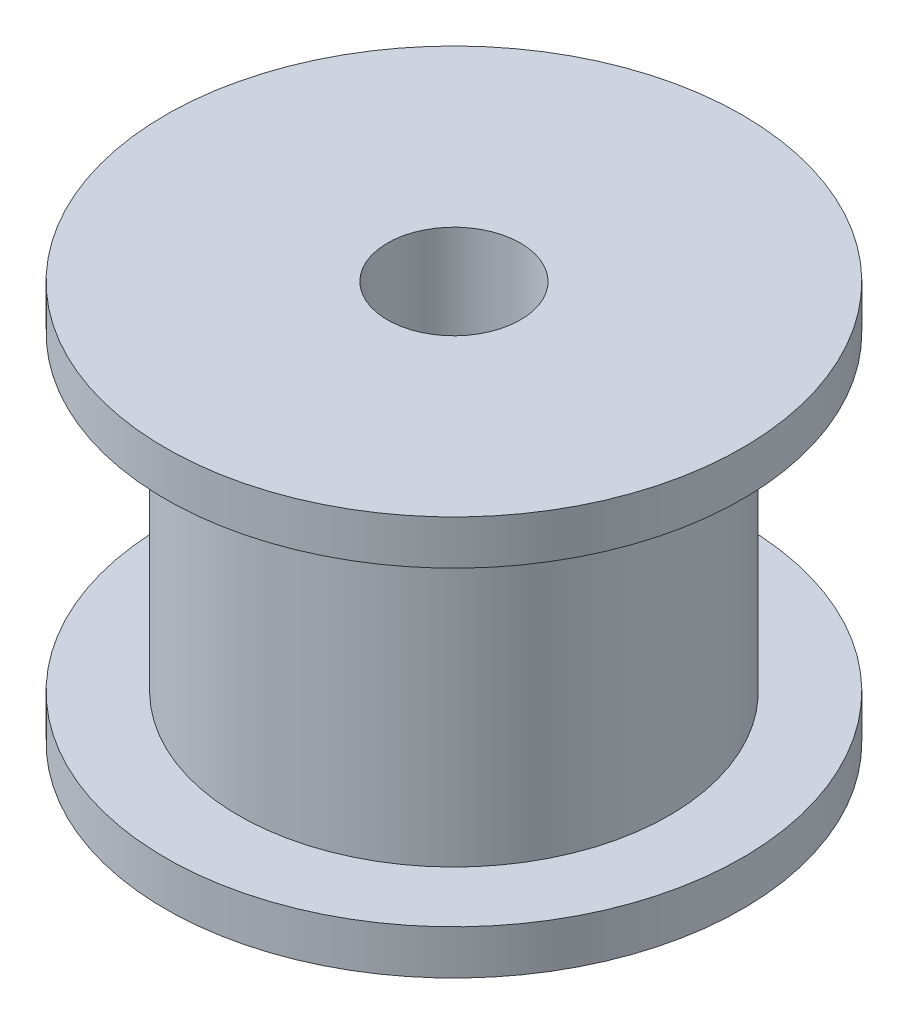
ISO-10303-21;
HEADER;
FILE_DESCRIPTION(('STEP AP214'),'2;1');
FILE_NAME('part.step','',(''),(''),'','','');
FILE_SCHEMA(('AUTOMOTIVE_DESIGN { 1 0 10303 214 1 1 1 1 }'));
ENDSEC;
DATA;
#1=APPLICATION_CONTEXT('core data for automotive mechanical design processes');
#2=APPLICATION_PROTOCOL_DEFINITION('international standard','automotive_design',2000,#1);
#3=PRODUCT_CONTEXT('',#1,'mechanical');
#4=PRODUCT('Part','Part','',(#3));
#5=PRODUCT_RELATED_PRODUCT_CATEGORY('part','',(#4));
#6=PRODUCT_DEFINITION_FORMATION('','',#4);
#7=PRODUCT_DEFINITION_CONTEXT('part definition',#1,'design');
#8=PRODUCT_DEFINITION('design','',#6,#7);
#9=PRODUCT_DEFINITION_SHAPE('','',#8);
#10=(LENGTH_UNIT() NAMED_UNIT(*) SI_UNIT(.MILLI.,.METRE.));
#11=(NAMED_UNIT(*) PLANE_ANGLE_UNIT() SI_UNIT($,.RADIAN.));
#12=(NAMED_UNIT(*) SI_UNIT($,.STERADIAN.) SOLID_ANGLE_UNIT());
#13=UNCERTAINTY_MEASURE_WITH_UNIT(LENGTH_MEASURE(1.E-05),#10,'distance_accuracy_value','');
#14=(GEOMETRIC_REPRESENTATION_CONTEXT(3) GLOBAL_UNCERTAINTY_ASSIGNED_CONTEXT((#13)) GLOBAL_UNIT_ASSIGNED_CONTEXT((#10,
#11,#12)) REPRESENTATION_CONTEXT('',''));
#15=CARTESIAN_POINT('',(0.,0.,0.));
#16=DIRECTION('',(0.,0.,1.));
#17=DIRECTION('',(1.,0.,0.));
#18=AXIS2_PLACEMENT_3D('',#15,#16,#17);
#19=CARTESIAN_POINT('',(0.,3.98382031084887,-6.5));
#20=DIRECTION('',(0.,-1.,0.));
#21=DIRECTION('',(0.,0.,-1.));
#22=AXIS2_PLACEMENT_3D('',#19,#20,#21);
#23=PLANE('',#22);
#24=CARTESIAN_POINT('',(0.,3.98382031084887,0.));
#25=DIRECTION('',(0.,-1.,0.));
#26=DIRECTION('',(0.,0.,-1.));
#27=AXIS2_PLACEMENT_3D('',#24,#25,#26);
#28=CIRCLE('',#27,6.5);
#29=CARTESIAN_POINT('',(0.,3.98382031084887,-6.5));
#30=VERTEX_POINT('',#29);
#31=EDGE_CURVE('E10',#30,#30,#28,.T.);
#32=ORIENTED_EDGE('',*,*,#31,.T.);
#33=EDGE_LOOP('',(#32));
#34=FACE_BOUND('',#33,.T.);
#35=CARTESIAN_POINT('',(0.,3.98382031084887,0.));
#36=DIRECTION('',(0.,-1.,0.));
#37=DIRECTION('',(0.,0.,-1.));
#38=AXIS2_PLACEMENT_3D('',#35,#36,#37);
#39=CIRCLE('',#38,4.85);
#40=CARTESIAN_POINT('',(0.,3.98382031084887,-4.85));
#41=VERTEX_POINT('',#40);
#42=EDGE_CURVE('E60',#41,#41,#39,.T.);
#43=ORIENTED_EDGE('',*,*,#42,.F.);
#44=EDGE_LOOP('',(#43));
#45=FACE_BOUND('',#44,.T.);
#46=ADVANCED_FACE('F32',(#34,#45),#23,.T.);
#47=CARTESIAN_POINT('',(0.,0.,0.));
#48=DIRECTION('',(0.,-1.,0.));
#49=DIRECTION('',(0.,0.,-1.));
#50=AXIS2_PLACEMENT_3D('',#47,#48,#49);
#51=CYLINDRICAL_SURFACE('',#50,6.5);
#52=CARTESIAN_POINT('',(0.,4.98382031084887,0.));
#53=DIRECTION('',(0.,-1.,0.));
#54=DIRECTION('',(0.,0.,-1.));
#55=AXIS2_PLACEMENT_3D('',#52,#53,#54);
#56=CIRCLE('',#55,6.5);
#57=CARTESIAN_POINT('',(0.,4.98382031084887,-6.5));
#58=VERTEX_POINT('',#57);
#59=EDGE_CURVE('E38',#58,#58,#56,.T.);
#60=ORIENTED_EDGE('',*,*,#59,.T.);
#61=EDGE_LOOP('',(#60));
#62=FACE_BOUND('',#61,.T.);
#63=ORIENTED_EDGE('',*,*,#31,.F.);
#64=EDGE_LOOP('',(#63));
#65=FACE_BOUND('',#64,.T.);
#66=ADVANCED_FACE('F68',(#62,#65),#51,.T.);
#67=CARTESIAN_POINT('',(0.,4.98382031084887,-1.5));
#68=DIRECTION('',(0.,1.,0.));
#69=DIRECTION('',(0.,0.,1.));
#70=AXIS2_PLACEMENT_3D('',#67,#68,#69);
#71=PLANE('',#70);
#72=CARTESIAN_POINT('',(0.,4.98382031084887,0.));
#73=DIRECTION('',(0.,-1.,0.));
#74=DIRECTION('',(0.,0.,-1.));
#75=AXIS2_PLACEMENT_3D('',#72,#73,#74);
#76=CIRCLE('',#75,1.5);
#77=CARTESIAN_POINT('',(0.,4.98382031084887,-1.5));
#78=VERTEX_POINT('',#77);
#79=EDGE_CURVE('E42',#78,#78,#76,.T.);
#80=ORIENTED_EDGE('',*,*,#79,.T.);
#81=EDGE_LOOP('',(#80));
#82=FACE_BOUND('',#81,.T.);
#83=ORIENTED_EDGE('',*,*,#59,.F.);
#84=EDGE_LOOP('',(#83));
#85=FACE_BOUND('',#84,.T.);
#86=ADVANCED_FACE('F72',(#82,#85),#71,.T.);
#87=CARTESIAN_POINT('',(0.,0.,0.));
#88=DIRECTION('',(0.,-1.,0.));
#89=DIRECTION('',(0.,0.,-1.));
#90=AXIS2_PLACEMENT_3D('',#87,#88,#89);
#91=CYLINDRICAL_SURFACE('',#90,1.5);
#92=CARTESIAN_POINT('',(0.,-4.01617968915113,0.));
#93=DIRECTION('',(0.,-1.,0.));
#94=DIRECTION('',(0.,0.,-1.));
#95=AXIS2_PLACEMENT_3D('',#92,#93,#94);
#96=CIRCLE('',#95,1.5);
#97=CARTESIAN_POINT('',(0.,-4.01617968915113,-1.5));
#98=VERTEX_POINT('',#97);
#99=EDGE_CURVE('E46',#98,#98,#96,.T.);
#100=ORIENTED_EDGE('',*,*,#99,.T.);
#101=EDGE_LOOP('',(#100));
#102=FACE_BOUND('',#101,.T.);
#103=ORIENTED_EDGE('',*,*,#79,.F.);
#104=EDGE_LOOP('',(#103));
#105=FACE_BOUND('',#104,.T.);
#106=ADVANCED_FACE('F76',(#102,#105),#91,.F.);
#107=CARTESIAN_POINT('',(0.,-4.01617968915113,-6.5));
#108=DIRECTION('',(0.,-1.,0.));
#109=DIRECTION('',(0.,0.,-1.));
#110=AXIS2_PLACEMENT_3D('',#107,#108,#109);
#111=PLANE('',#110);
#112=CARTESIAN_POINT('',(0.,-4.01617968915113,0.));
#113=DIRECTION('',(0.,-1.,0.));
#114=DIRECTION('',(0.,0.,-1.));
#115=AXIS2_PLACEMENT_3D('',#112,#113,#114);
#116=CIRCLE('',#115,6.5);
#117=CARTESIAN_POINT('',(0.,-4.01617968915113,-6.5));
#118=VERTEX_POINT('',#117);
#119=EDGE_CURVE('E51',#118,#118,#116,.T.);
#120=ORIENTED_EDGE('',*,*,#119,.T.);
#121=EDGE_LOOP('',(#120));
#122=FACE_BOUND('',#121,.T.);
#123=ORIENTED_EDGE('',*,*,#99,.F.);
#124=EDGE_LOOP('',(#123));
#125=FACE_BOUND('',#124,.T.);
#126=ADVANCED_FACE('F83',(#122,#125),#111,.T.);
#127=CARTESIAN_POINT('',(0.,0.,0.));
#128=DIRECTION('',(0.,-1.,0.));
#129=DIRECTION('',(0.,0.,-1.));
#130=AXIS2_PLACEMENT_3D('',#127,#128,#129);
#131=CYLINDRICAL_SURFACE('',#130,6.5);
#132=CARTESIAN_POINT('',(0.,-3.01617968915113,0.));
#133=DIRECTION('',(0.,-1.,0.));
#134=DIRECTION('',(0.,0.,-1.));
#135=AXIS2_PLACEMENT_3D('',#132,#133,#134);
#136=CIRCLE('',#135,6.5);
#137=CARTESIAN_POINT('',(0.,-3.01617968915113,-6.5));
#138=VERTEX_POINT('',#137);
#139=EDGE_CURVE('E54',#138,#138,#136,.T.);
#140=ORIENTED_EDGE('',*,*,#139,.T.);
#141=EDGE_LOOP('',(#140));
#142=FACE_BOUND('',#141,.T.);
#143=ORIENTED_EDGE('',*,*,#119,.F.);
#144=EDGE_LOOP('',(#143));
#145=FACE_BOUND('',#144,.T.);
#146=ADVANCED_FACE('F87',(#142,#145),#131,.T.);
#147=CARTESIAN_POINT('',(0.,-3.01617968915113,-4.85));
#148=DIRECTION('',(0.,1.,0.));
#149=DIRECTION('',(0.,0.,1.));
#150=AXIS2_PLACEMENT_3D('',#147,#148,#149);
#151=PLANE('',#150);
#152=CARTESIAN_POINT('',(0.,-3.01617968915113,0.));
#153=DIRECTION('',(0.,-1.,0.));
#154=DIRECTION('',(0.,0.,-1.));
#155=AXIS2_PLACEMENT_3D('',#152,#153,#154);
#156=CIRCLE('',#155,4.85);
#157=CARTESIAN_POINT('',(0.,-3.01617968915113,-4.85));
#158=VERTEX_POINT('',#157);
#159=EDGE_CURVE('E57',#158,#158,#156,.T.);
#160=ORIENTED_EDGE('',*,*,#159,.T.);
#161=EDGE_LOOP('',(#160));
#162=FACE_BOUND('',#161,.T.);
#163=ORIENTED_EDGE('',*,*,#139,.F.);
#164=EDGE_LOOP('',(#163));
#165=FACE_BOUND('',#164,.T.);
#166=ADVANCED_FACE('F91',(#162,#165),#151,.T.);
#167=CARTESIAN_POINT('',(0.,0.,0.));
#168=DIRECTION('',(0.,-1.,0.));
#169=DIRECTION('',(0.,0.,-1.));
#170=AXIS2_PLACEMENT_3D('',#167,#168,#169);
#171=CYLINDRICAL_SURFACE('',#170,4.85);
#172=ORIENTED_EDGE('',*,*,#42,.T.);
#173=EDGE_LOOP('',(#172));
#174=FACE_BOUND('',#173,.T.);
#175=ORIENTED_EDGE('',*,*,#159,.F.);
#176=EDGE_LOOP('',(#175));
#177=FACE_BOUND('',#176,.T.);
#178=ADVANCED_FACE('F64',(#174,#177),#171,.T.);
#179=CLOSED_SHELL('',(#46,#66,#86,#106,#126,#146,#166,#178));
#180=MANIFOLD_SOLID_BREP('B2',#179);
#181=ADVANCED_BREP_SHAPE_REPRESENTATION('',(#18,#180),#14);
#182=SHAPE_DEFINITION_REPRESENTATION(#9,#181);
ENDSEC;
END-ISO-10303-21;
